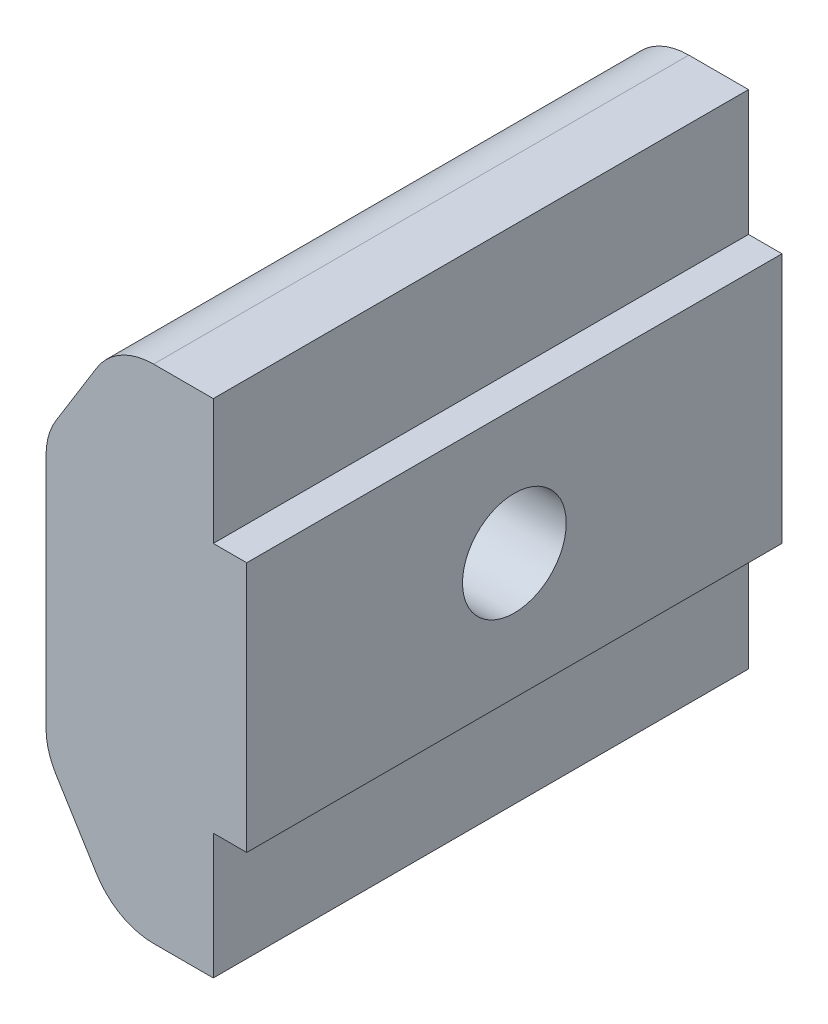
ISO-10303-21;
HEADER;
FILE_DESCRIPTION(('STEP AP214'),'2;1');
FILE_NAME('part.step','',(''),(''),'','','');
FILE_SCHEMA(('AUTOMOTIVE_DESIGN { 1 0 10303 214 1 1 1 1 }'));
ENDSEC;
DATA;
#1=APPLICATION_CONTEXT('core data for automotive mechanical design processes');
#2=APPLICATION_PROTOCOL_DEFINITION('international standard','automotive_design',2000,#1);
#3=PRODUCT_CONTEXT('',#1,'mechanical');
#4=PRODUCT('Part','Part','',(#3));
#5=PRODUCT_RELATED_PRODUCT_CATEGORY('part','',(#4));
#6=PRODUCT_DEFINITION_FORMATION('','',#4);
#7=PRODUCT_DEFINITION_CONTEXT('part definition',#1,'design');
#8=PRODUCT_DEFINITION('design','',#6,#7);
#9=PRODUCT_DEFINITION_SHAPE('','',#8);
#10=(LENGTH_UNIT() NAMED_UNIT(*) SI_UNIT(.MILLI.,.METRE.));
#11=(NAMED_UNIT(*) PLANE_ANGLE_UNIT() SI_UNIT($,.RADIAN.));
#12=(NAMED_UNIT(*) SI_UNIT($,.STERADIAN.) SOLID_ANGLE_UNIT());
#13=UNCERTAINTY_MEASURE_WITH_UNIT(LENGTH_MEASURE(1.E-05),#10,'distance_accuracy_value','');
#14=(GEOMETRIC_REPRESENTATION_CONTEXT(3) GLOBAL_UNCERTAINTY_ASSIGNED_CONTEXT((#13)) GLOBAL_UNIT_ASSIGNED_CONTEXT((#10,
#11,#12)) REPRESENTATION_CONTEXT('',''));
#15=CARTESIAN_POINT('',(0.,0.,0.));
#16=DIRECTION('',(0.,0.,1.));
#17=DIRECTION('',(1.,0.,0.));
#18=AXIS2_PLACEMENT_3D('',#15,#16,#17);
#19=CARTESIAN_POINT('',(5.,-3.4,16.));
#20=DIRECTION('',(-1.,0.,0.));
#21=DIRECTION('',(0.,-1.,0.));
#22=AXIS2_PLACEMENT_3D('',#19,#20,#21);
#23=PLANE('',#22);
#24=DIRECTION('',(0.,0.,-1.));
#25=VECTOR('',#24,1.);
#26=CARTESIAN_POINT('',(5.,0.349999999999997,16.));
#27=LINE('',#26,#25);
#28=CARTESIAN_POINT('',(5.,0.349999999999995,16.));
#29=VERTEX_POINT('',#28);
#30=CARTESIAN_POINT('',(5.,0.349999999999995,0.));
#31=VERTEX_POINT('',#30);
#32=EDGE_CURVE('E54',#29,#31,#27,.T.);
#33=ORIENTED_EDGE('',*,*,#32,.F.);
#34=DIRECTION('',(0.,1.,0.));
#35=VECTOR('',#34,1.);
#36=CARTESIAN_POINT('',(5.,-3.4,16.));
#37=LINE('',#36,#35);
#38=CARTESIAN_POINT('',(5.,-3.4,16.));
#39=VERTEX_POINT('',#38);
#40=EDGE_CURVE('E255',#39,#29,#37,.T.);
#41=ORIENTED_EDGE('',*,*,#40,.F.);
#42=DIRECTION('',(0.,0.,-1.));
#43=VECTOR('',#42,1.);
#44=CARTESIAN_POINT('',(5.,-3.4,16.));
#45=LINE('',#44,#43);
#46=CARTESIAN_POINT('',(5.,-3.4,0.));
#47=VERTEX_POINT('',#46);
#48=EDGE_CURVE('E272',#39,#47,#45,.T.);
#49=ORIENTED_EDGE('',*,*,#48,.T.);
#50=DIRECTION('',(0.,1.,0.));
#51=VECTOR('',#50,1.);
#52=CARTESIAN_POINT('',(5.,-3.4,0.));
#53=LINE('',#52,#51);
#54=EDGE_CURVE('E273',#47,#31,#53,.T.);
#55=ORIENTED_EDGE('',*,*,#54,.T.);
#56=EDGE_LOOP('',(#33,#41,#49,#55));
#57=FACE_BOUND('',#56,.T.);
#58=ADVANCED_FACE('F37',(#57),#23,.F.);
#59=DIRECTION('',(0.,0.,1.));
#60=VECTOR('',#59,1.);
#61=CARTESIAN_POINT('',(5.,7.85,16.));
#62=LINE('',#61,#60);
#63=CARTESIAN_POINT('',(5.,7.84999999999999,0.));
#64=VERTEX_POINT('',#63);
#65=CARTESIAN_POINT('',(5.,7.85,16.));
#66=VERTEX_POINT('',#65);
#67=EDGE_CURVE('E62',#64,#66,#62,.T.);
#68=ORIENTED_EDGE('',*,*,#67,.F.);
#69=CARTESIAN_POINT('',(5.,11.6,0.));
#70=VERTEX_POINT('',#69);
#71=EDGE_CURVE('E276',#64,#70,#53,.T.);
#72=ORIENTED_EDGE('',*,*,#71,.T.);
#73=DIRECTION('',(0.,0.,-1.));
#74=VECTOR('',#73,1.);
#75=CARTESIAN_POINT('',(5.,11.6,16.));
#76=LINE('',#75,#74);
#77=CARTESIAN_POINT('',(5.,11.6,16.));
#78=VERTEX_POINT('',#77);
#79=EDGE_CURVE('E292',#78,#70,#76,.T.);
#80=ORIENTED_EDGE('',*,*,#79,.F.);
#81=EDGE_CURVE('E258',#66,#78,#37,.T.);
#82=ORIENTED_EDGE('',*,*,#81,.F.);
#83=EDGE_LOOP('',(#68,#72,#80,#82));
#84=FACE_BOUND('',#83,.T.);
#85=ADVANCED_FACE('F390',(#84),#23,.F.);
#86=CARTESIAN_POINT('',(9.38406204335659,4.1,8.));
#87=DIRECTION('',(-1.,0.,0.));
#88=DIRECTION('',(0.,-1.,0.));
#89=AXIS2_PLACEMENT_3D('',#86,#87,#88);
#90=CYLINDRICAL_SURFACE('',#89,1.55);
#91=CARTESIAN_POINT('',(2.5,4.1,8.));
#92=DIRECTION('',(-1.,0.,0.));
#93=DIRECTION('',(0.,-1.,0.));
#94=AXIS2_PLACEMENT_3D('',#91,#92,#93);
#95=CIRCLE('',#94,1.55);
#96=CARTESIAN_POINT('',(2.5,2.55,8.));
#97=VERTEX_POINT('',#96);
#98=EDGE_CURVE('E244',#97,#97,#95,.F.);
#99=ORIENTED_EDGE('',*,*,#98,.F.);
#100=EDGE_LOOP('',(#99));
#101=FACE_BOUND('',#100,.T.);
#102=CARTESIAN_POINT('',(6.,4.1,8.));
#103=DIRECTION('',(1.,0.,0.));
#104=DIRECTION('',(0.,1.,0.));
#105=AXIS2_PLACEMENT_3D('',#102,#103,#104);
#106=CIRCLE('',#105,1.55);
#107=CARTESIAN_POINT('',(6.,5.65,8.));
#108=VERTEX_POINT('',#107);
#109=EDGE_CURVE('E372',#108,#108,#106,.T.);
#110=ORIENTED_EDGE('',*,*,#109,.T.);
#111=EDGE_LOOP('',(#110));
#112=FACE_BOUND('',#111,.T.);
#113=ADVANCED_FACE('F378',(#101,#112),#90,.F.);
#114=CARTESIAN_POINT('',(2.1,11.6,16.));
#115=DIRECTION('',(0.,-1.,0.));
#116=DIRECTION('',(0.,0.,-1.));
#117=AXIS2_PLACEMENT_3D('',#114,#115,#116);
#118=PLANE('',#117);
#119=DIRECTION('',(-1.,0.,0.));
#120=VECTOR('',#119,1.);
#121=CARTESIAN_POINT('',(2.1,11.6,0.));
#122=LINE('',#121,#120);
#123=CARTESIAN_POINT('',(3.21544014149272,11.6,0.));
#124=VERTEX_POINT('',#123);
#125=EDGE_CURVE('E275',#70,#124,#122,.T.);
#126=ORIENTED_EDGE('',*,*,#125,.T.);
#127=DIRECTION('',(0.,0.,-1.));
#128=VECTOR('',#127,1.);
#129=CARTESIAN_POINT('',(3.21544014149272,11.6,16.));
#130=LINE('',#129,#128);
#131=CARTESIAN_POINT('',(3.21544014149272,11.6,16.));
#132=VERTEX_POINT('',#131);
#133=EDGE_CURVE('E11',#124,#132,#130,.F.);
#134=ORIENTED_EDGE('',*,*,#133,.T.);
#135=DIRECTION('',(-1.,0.,0.));
#136=VECTOR('',#135,1.);
#137=CARTESIAN_POINT('',(2.1,11.6,16.));
#138=LINE('',#137,#136);
#139=EDGE_CURVE('E257',#78,#132,#138,.T.);
#140=ORIENTED_EDGE('',*,*,#139,.F.);
#141=ORIENTED_EDGE('',*,*,#79,.T.);
#142=EDGE_LOOP('',(#126,#134,#140,#141));
#143=FACE_BOUND('',#142,.T.);
#144=ADVANCED_FACE('F397',(#143),#118,.F.);
#145=CARTESIAN_POINT('',(0.,8.2,16.));
#146=DIRECTION('',(0.850797997359292,-0.525492880721916,0.));
#147=DIRECTION('',(0.525492880721916,0.850797997359292,0.));
#148=AXIS2_PLACEMENT_3D('',#145,#146,#147);
#149=PLANE('',#148);
#150=DIRECTION('',(-0.525492880721916,-0.850797997359292,0.));
#151=VECTOR('',#150,1.);
#152=CARTESIAN_POINT('',(0.,8.2,0.));
#153=LINE('',#152,#151);
#154=CARTESIAN_POINT('',(1.51384414677413,10.6509857614438,0.));
#155=VERTEX_POINT('',#154);
#156=CARTESIAN_POINT('',(0.298404005281414,8.68313029426515,0.));
#157=VERTEX_POINT('',#156);
#158=EDGE_CURVE('E279',#155,#157,#153,.T.);
#159=ORIENTED_EDGE('',*,*,#158,.T.);
#160=DIRECTION('',(0.,0.,-1.));
#161=VECTOR('',#160,1.);
#162=CARTESIAN_POINT('',(0.298404005281414,8.68313029426515,16.));
#163=LINE('',#162,#161);
#164=CARTESIAN_POINT('',(0.298404005281414,8.68313029426515,16.));
#165=VERTEX_POINT('',#164);
#166=EDGE_CURVE('E45',#157,#165,#163,.F.);
#167=ORIENTED_EDGE('',*,*,#166,.T.);
#168=DIRECTION('',(-0.525492880721916,-0.850797997359292,0.));
#169=VECTOR('',#168,1.);
#170=CARTESIAN_POINT('',(0.,8.2,16.));
#171=LINE('',#170,#169);
#172=CARTESIAN_POINT('',(1.51384414677413,10.6509857614438,16.));
#173=VERTEX_POINT('',#172);
#174=EDGE_CURVE('E261',#173,#165,#171,.T.);
#175=ORIENTED_EDGE('',*,*,#174,.F.);
#176=DIRECTION('',(0.,0.,-1.));
#177=VECTOR('',#176,1.);
#178=CARTESIAN_POINT('',(1.51384414677413,10.6509857614438,16.));
#179=LINE('',#178,#177);
#180=EDGE_CURVE('E326',#173,#155,#179,.T.);
#181=ORIENTED_EDGE('',*,*,#180,.T.);
#182=EDGE_LOOP('',(#159,#167,#175,#181));
#183=FACE_BOUND('',#182,.T.);
#184=ADVANCED_FACE('F331',(#183),#149,.F.);
#185=CARTESIAN_POINT('',(0.,0.,16.));
#186=DIRECTION('',(1.,0.,0.));
#187=DIRECTION('',(0.,1.,0.));
#188=AXIS2_PLACEMENT_3D('',#185,#186,#187);
#189=PLANE('',#188);
#190=DIRECTION('',(0.,0.866025403784439,-0.5));
#191=VECTOR('',#190,1.);
#192=CARTESIAN_POINT('',(0.,4.1,11.3486315612998));
#193=LINE('',#192,#191);
#194=CARTESIAN_POINT('',(0.,4.1,11.3486315612998));
#195=VERTEX_POINT('',#194);
#196=CARTESIAN_POINT('',(0.,6.99999999999999,9.67431578064991));
#197=VERTEX_POINT('',#196);
#198=EDGE_CURVE('E203',#195,#197,#193,.T.);
#199=ORIENTED_EDGE('',*,*,#198,.F.);
#200=DIRECTION('',(0.,0.866025403784439,0.5));
#201=VECTOR('',#200,1.);
#202=CARTESIAN_POINT('',(0.,1.2,9.67431578064991));
#203=LINE('',#202,#201);
#204=CARTESIAN_POINT('',(0.,1.2,9.67431578064991));
#205=VERTEX_POINT('',#204);
#206=EDGE_CURVE('E201',#205,#195,#203,.T.);
#207=ORIENTED_EDGE('',*,*,#206,.F.);
#208=DIRECTION('',(0.,0.,1.));
#209=VECTOR('',#208,1.);
#210=CARTESIAN_POINT('',(0.,1.2,6.32568421935009));
#211=LINE('',#210,#209);
#212=CARTESIAN_POINT('',(0.,1.2,6.32568421935009));
#213=VERTEX_POINT('',#212);
#214=EDGE_CURVE('E213',#213,#205,#211,.T.);
#215=ORIENTED_EDGE('',*,*,#214,.F.);
#216=DIRECTION('',(0.,-0.866025403784439,0.5));
#217=VECTOR('',#216,1.);
#218=CARTESIAN_POINT('',(0.,4.1,4.65136843870017));
#219=LINE('',#218,#217);
#220=CARTESIAN_POINT('',(0.,4.1,4.65136843870017));
#221=VERTEX_POINT('',#220);
#222=EDGE_CURVE('E237',#221,#213,#219,.T.);
#223=ORIENTED_EDGE('',*,*,#222,.F.);
#224=DIRECTION('',(0.,-0.866025403784439,-0.5));
#225=VECTOR('',#224,1.);
#226=CARTESIAN_POINT('',(0.,7.,6.32568421935009));
#227=LINE('',#226,#225);
#228=CARTESIAN_POINT('',(0.,7.,6.32568421935009));
#229=VERTEX_POINT('',#228);
#230=EDGE_CURVE('E234',#229,#221,#227,.T.);
#231=ORIENTED_EDGE('',*,*,#230,.F.);
#232=DIRECTION('',(0.,0.,-1.));
#233=VECTOR('',#232,1.);
#234=CARTESIAN_POINT('',(0.,6.99999999999999,9.67431578064991));
#235=LINE('',#234,#233);
#236=EDGE_CURVE('E231',#197,#229,#235,.T.);
#237=ORIENTED_EDGE('',*,*,#236,.F.);
#238=EDGE_LOOP('',(#199,#207,#215,#223,#231,#237));
#239=FACE_BOUND('',#238,.T.);
#240=DIRECTION('',(0.,-1.,0.));
#241=VECTOR('',#240,1.);
#242=CARTESIAN_POINT('',(0.,0.,0.));
#243=LINE('',#242,#241);
#244=CARTESIAN_POINT('',(0.,7.63214453282131,0.));
#245=VERTEX_POINT('',#244);
#246=CARTESIAN_POINT('',(0.,0.567855467178683,0.));
#247=VERTEX_POINT('',#246);
#248=EDGE_CURVE('E282',#245,#247,#243,.T.);
#249=ORIENTED_EDGE('',*,*,#248,.T.);
#250=DIRECTION('',(0.,0.,-1.));
#251=VECTOR('',#250,1.);
#252=CARTESIAN_POINT('',(0.,0.567855467178683,16.));
#253=LINE('',#252,#251);
#254=CARTESIAN_POINT('',(0.,0.567855467178683,16.));
#255=VERTEX_POINT('',#254);
#256=EDGE_CURVE('E324',#247,#255,#253,.F.);
#257=ORIENTED_EDGE('',*,*,#256,.T.);
#258=DIRECTION('',(0.,-1.,0.));
#259=VECTOR('',#258,1.);
#260=CARTESIAN_POINT('',(0.,0.,16.));
#261=LINE('',#260,#259);
#262=CARTESIAN_POINT('',(0.,7.63214453282131,16.));
#263=VERTEX_POINT('',#262);
#264=EDGE_CURVE('E264',#263,#255,#261,.T.);
#265=ORIENTED_EDGE('',*,*,#264,.F.);
#266=DIRECTION('',(0.,0.,-1.));
#267=VECTOR('',#266,1.);
#268=CARTESIAN_POINT('',(0.,7.63214453282131,16.));
#269=LINE('',#268,#267);
#270=EDGE_CURVE('E321',#263,#245,#269,.T.);
#271=ORIENTED_EDGE('',*,*,#270,.T.);
#272=EDGE_LOOP('',(#249,#257,#265,#271));
#273=FACE_BOUND('',#272,.T.);
#274=ADVANCED_FACE('F344',(#239,#273),#189,.F.);
#275=CARTESIAN_POINT('',(0.,0.,16.));
#276=DIRECTION('',(0.850797997359292,0.525492880721916,0.));
#277=DIRECTION('',(-0.525492880721916,0.850797997359292,0.));
#278=AXIS2_PLACEMENT_3D('',#275,#276,#277);
#279=PLANE('',#278);
#280=DIRECTION('',(0.525492880721916,-0.850797997359292,0.));
#281=VECTOR('',#280,1.);
#282=CARTESIAN_POINT('',(0.,0.,0.));
#283=LINE('',#282,#281);
#284=CARTESIAN_POINT('',(0.298404005281415,-0.483130294265149,0.));
#285=VERTEX_POINT('',#284);
#286=CARTESIAN_POINT('',(1.51384414677413,-2.45098576144383,0.));
#287=VERTEX_POINT('',#286);
#288=EDGE_CURVE('E285',#285,#287,#283,.T.);
#289=ORIENTED_EDGE('',*,*,#288,.T.);
#290=DIRECTION('',(0.,0.,-1.));
#291=VECTOR('',#290,1.);
#292=CARTESIAN_POINT('',(1.51384414677413,-2.45098576144383,16.));
#293=LINE('',#292,#291);
#294=CARTESIAN_POINT('',(1.51384414677413,-2.45098576144383,16.));
#295=VERTEX_POINT('',#294);
#296=EDGE_CURVE('E311',#287,#295,#293,.F.);
#297=ORIENTED_EDGE('',*,*,#296,.T.);
#298=DIRECTION('',(0.525492880721916,-0.850797997359292,0.));
#299=VECTOR('',#298,1.);
#300=CARTESIAN_POINT('',(0.,0.,16.));
#301=LINE('',#300,#299);
#302=CARTESIAN_POINT('',(0.298404005281415,-0.483130294265149,16.));
#303=VERTEX_POINT('',#302);
#304=EDGE_CURVE('E267',#303,#295,#301,.T.);
#305=ORIENTED_EDGE('',*,*,#304,.F.);
#306=DIRECTION('',(0.,0.,-1.));
#307=VECTOR('',#306,1.);
#308=CARTESIAN_POINT('',(0.298404005281415,-0.483130294265149,16.));
#309=LINE('',#308,#307);
#310=EDGE_CURVE('E308',#303,#285,#309,.T.);
#311=ORIENTED_EDGE('',*,*,#310,.T.);
#312=EDGE_LOOP('',(#289,#297,#305,#311));
#313=FACE_BOUND('',#312,.T.);
#314=ADVANCED_FACE('F353',(#313),#279,.F.);
#315=CARTESIAN_POINT('',(2.1,-3.4,16.));
#316=DIRECTION('',(0.,1.,0.));
#317=DIRECTION('',(-1.,0.,0.));
#318=AXIS2_PLACEMENT_3D('',#315,#316,#317);
#319=PLANE('',#318);
#320=DIRECTION('',(1.,0.,0.));
#321=VECTOR('',#320,1.);
#322=CARTESIAN_POINT('',(2.1,-3.4,16.));
#323=LINE('',#322,#321);
#324=CARTESIAN_POINT('',(3.21544014149272,-3.4,16.));
#325=VERTEX_POINT('',#324);
#326=EDGE_CURVE('E270',#325,#39,#323,.T.);
#327=ORIENTED_EDGE('',*,*,#326,.F.);
#328=DIRECTION('',(0.,0.,-1.));
#329=VECTOR('',#328,1.);
#330=CARTESIAN_POINT('',(3.21544014149272,-3.4,16.));
#331=LINE('',#330,#329);
#332=CARTESIAN_POINT('',(3.21544014149272,-3.4,0.));
#333=VERTEX_POINT('',#332);
#334=EDGE_CURVE('E295',#325,#333,#331,.T.);
#335=ORIENTED_EDGE('',*,*,#334,.T.);
#336=DIRECTION('',(1.,0.,0.));
#337=VECTOR('',#336,1.);
#338=CARTESIAN_POINT('',(2.1,-3.4,0.));
#339=LINE('',#338,#337);
#340=EDGE_CURVE('E288',#333,#47,#339,.T.);
#341=ORIENTED_EDGE('',*,*,#340,.T.);
#342=ORIENTED_EDGE('',*,*,#48,.F.);
#343=EDGE_LOOP('',(#327,#335,#341,#342));
#344=FACE_BOUND('',#343,.T.);
#345=ADVANCED_FACE('F361',(#344),#319,.F.);
#346=CARTESIAN_POINT('',(0.,0.,16.));
#347=DIRECTION('',(0.,0.,-1.));
#348=DIRECTION('',(-1.,0.,0.));
#349=AXIS2_PLACEMENT_3D('',#346,#347,#348);
#350=PLANE('',#349);
#351=ORIENTED_EDGE('',*,*,#304,.T.);
#352=CARTESIAN_POINT('',(3.21544014149272,-1.4,16.));
#353=DIRECTION('',(0.,0.,-1.));
#354=DIRECTION('',(-1.,0.,0.));
#355=AXIS2_PLACEMENT_3D('',#352,#353,#354);
#356=CIRCLE('',#355,2.);
#357=EDGE_CURVE('E319',#295,#325,#356,.F.);
#358=ORIENTED_EDGE('',*,*,#357,.T.);
#359=ORIENTED_EDGE('',*,*,#326,.T.);
#360=ORIENTED_EDGE('',*,*,#40,.T.);
#361=DIRECTION('',(-1.,0.,0.));
#362=VECTOR('',#361,1.);
#363=CARTESIAN_POINT('',(6.,0.349999999999997,16.));
#364=LINE('',#363,#362);
#365=CARTESIAN_POINT('',(6.,0.349999999999997,16.));
#366=VERTEX_POINT('',#365);
#367=EDGE_CURVE('E363',#366,#29,#364,.T.);
#368=ORIENTED_EDGE('',*,*,#367,.F.);
#369=DIRECTION('',(0.,-1.,0.));
#370=VECTOR('',#369,1.);
#371=CARTESIAN_POINT('',(6.,7.85,16.));
#372=LINE('',#371,#370);
#373=CARTESIAN_POINT('',(6.,7.85,16.));
#374=VERTEX_POINT('',#373);
#375=EDGE_CURVE('E194',#374,#366,#372,.T.);
#376=ORIENTED_EDGE('',*,*,#375,.F.);
#377=DIRECTION('',(-1.,0.,0.));
#378=VECTOR('',#377,1.);
#379=CARTESIAN_POINT('',(6.,7.85,16.));
#380=LINE('',#379,#378);
#381=EDGE_CURVE('E205',#374,#66,#380,.T.);
#382=ORIENTED_EDGE('',*,*,#381,.T.);
#383=ORIENTED_EDGE('',*,*,#81,.T.);
#384=ORIENTED_EDGE('',*,*,#139,.T.);
#385=CARTESIAN_POINT('',(3.21544014149272,9.6,16.));
#386=DIRECTION('',(0.,0.,-1.));
#387=DIRECTION('',(-1.,0.,0.));
#388=AXIS2_PLACEMENT_3D('',#385,#386,#387);
#389=CIRCLE('',#388,2.);
#390=EDGE_CURVE('E313',#132,#173,#389,.F.);
#391=ORIENTED_EDGE('',*,*,#390,.T.);
#392=ORIENTED_EDGE('',*,*,#174,.T.);
#393=CARTESIAN_POINT('',(2.,7.63214453282131,16.));
#394=DIRECTION('',(0.,0.,-1.));
#395=DIRECTION('',(-1.,0.,0.));
#396=AXIS2_PLACEMENT_3D('',#393,#394,#395);
#397=CIRCLE('',#396,2.);
#398=EDGE_CURVE('E315',#165,#263,#397,.F.);
#399=ORIENTED_EDGE('',*,*,#398,.T.);
#400=ORIENTED_EDGE('',*,*,#264,.T.);
#401=CARTESIAN_POINT('',(2.,0.567855467178683,16.));
#402=DIRECTION('',(0.,0.,-1.));
#403=DIRECTION('',(-1.,0.,0.));
#404=AXIS2_PLACEMENT_3D('',#401,#402,#403);
#405=CIRCLE('',#404,2.);
#406=EDGE_CURVE('E317',#255,#303,#405,.F.);
#407=ORIENTED_EDGE('',*,*,#406,.T.);
#408=EDGE_LOOP('',(#351,#358,#359,#360,#368,#376,#382,#383,#384,#391,#392,#399,#400,#407));
#409=FACE_BOUND('',#408,.T.);
#410=ADVANCED_FACE('F337',(#409),#350,.F.);
#411=CARTESIAN_POINT('',(0.,0.,0.));
#412=DIRECTION('',(0.,0.,-1.));
#413=DIRECTION('',(-1.,0.,0.));
#414=AXIS2_PLACEMENT_3D('',#411,#412,#413);
#415=PLANE('',#414);
#416=ORIENTED_EDGE('',*,*,#340,.F.);
#417=CARTESIAN_POINT('',(3.21544014149272,-1.4,0.));
#418=DIRECTION('',(0.,0.,-1.));
#419=DIRECTION('',(-1.,0.,0.));
#420=AXIS2_PLACEMENT_3D('',#417,#418,#419);
#421=CIRCLE('',#420,2.);
#422=EDGE_CURVE('E306',#333,#287,#421,.T.);
#423=ORIENTED_EDGE('',*,*,#422,.T.);
#424=ORIENTED_EDGE('',*,*,#288,.F.);
#425=CARTESIAN_POINT('',(2.,0.567855467178683,0.));
#426=DIRECTION('',(0.,0.,-1.));
#427=DIRECTION('',(-1.,0.,0.));
#428=AXIS2_PLACEMENT_3D('',#425,#426,#427);
#429=CIRCLE('',#428,2.);
#430=EDGE_CURVE('E304',#285,#247,#429,.T.);
#431=ORIENTED_EDGE('',*,*,#430,.T.);
#432=ORIENTED_EDGE('',*,*,#248,.F.);
#433=CARTESIAN_POINT('',(2.,7.63214453282131,0.));
#434=DIRECTION('',(0.,0.,-1.));
#435=DIRECTION('',(-1.,0.,0.));
#436=AXIS2_PLACEMENT_3D('',#433,#434,#435);
#437=CIRCLE('',#436,2.);
#438=EDGE_CURVE('E302',#245,#157,#437,.T.);
#439=ORIENTED_EDGE('',*,*,#438,.T.);
#440=ORIENTED_EDGE('',*,*,#158,.F.);
#441=CARTESIAN_POINT('',(3.21544014149272,9.6,0.));
#442=DIRECTION('',(0.,0.,-1.));
#443=DIRECTION('',(-1.,0.,0.));
#444=AXIS2_PLACEMENT_3D('',#441,#442,#443);
#445=CIRCLE('',#444,2.);
#446=EDGE_CURVE('E300',#155,#124,#445,.T.);
#447=ORIENTED_EDGE('',*,*,#446,.T.);
#448=ORIENTED_EDGE('',*,*,#125,.F.);
#449=ORIENTED_EDGE('',*,*,#71,.F.);
#450=DIRECTION('',(-1.,0.,0.));
#451=VECTOR('',#450,1.);
#452=CARTESIAN_POINT('',(6.,7.84999999999999,0.));
#453=LINE('',#452,#451);
#454=CARTESIAN_POINT('',(6.,7.84999999999999,0.));
#455=VERTEX_POINT('',#454);
#456=EDGE_CURVE('E184',#455,#64,#453,.T.);
#457=ORIENTED_EDGE('',*,*,#456,.F.);
#458=DIRECTION('',(0.,1.,0.));
#459=VECTOR('',#458,1.);
#460=CARTESIAN_POINT('',(6.,7.84999999999999,0.));
#461=LINE('',#460,#459);
#462=CARTESIAN_POINT('',(6.,0.349999999999996,0.));
#463=VERTEX_POINT('',#462);
#464=EDGE_CURVE('E176',#463,#455,#461,.T.);
#465=ORIENTED_EDGE('',*,*,#464,.F.);
#466=DIRECTION('',(-1.,0.,0.));
#467=VECTOR('',#466,1.);
#468=CARTESIAN_POINT('',(6.,0.349999999999996,0.));
#469=LINE('',#468,#467);
#470=EDGE_CURVE('E182',#463,#31,#469,.T.);
#471=ORIENTED_EDGE('',*,*,#470,.T.);
#472=ORIENTED_EDGE('',*,*,#54,.F.);
#473=EDGE_LOOP('',(#416,#423,#424,#431,#432,#439,#440,#447,#448,#449,#457,#465,#471,#472));
#474=FACE_BOUND('',#473,.T.);
#475=ADVANCED_FACE('F179',(#474),#415,.T.);
#476=CARTESIAN_POINT('',(2.5,0.,0.));
#477=DIRECTION('',(-1.,0.,0.));
#478=DIRECTION('',(0.,-1.,0.));
#479=AXIS2_PLACEMENT_3D('',#476,#477,#478);
#480=PLANE('',#479);
#481=DIRECTION('',(0.,0.866025403784439,0.5));
#482=VECTOR('',#481,1.);
#483=CARTESIAN_POINT('',(2.5,1.2,9.67431578064991));
#484=LINE('',#483,#482);
#485=CARTESIAN_POINT('',(2.5,1.2,9.67431578064991));
#486=VERTEX_POINT('',#485);
#487=CARTESIAN_POINT('',(2.5,4.1,11.3486315612998));
#488=VERTEX_POINT('',#487);
#489=EDGE_CURVE('E209',#486,#488,#484,.T.);
#490=ORIENTED_EDGE('',*,*,#489,.T.);
#491=DIRECTION('',(0.,0.866025403784439,-0.5));
#492=VECTOR('',#491,1.);
#493=CARTESIAN_POINT('',(2.5,4.1,11.3486315612998));
#494=LINE('',#493,#492);
#495=CARTESIAN_POINT('',(2.5,6.99999999999999,9.67431578064991));
#496=VERTEX_POINT('',#495);
#497=EDGE_CURVE('E212',#488,#496,#494,.T.);
#498=ORIENTED_EDGE('',*,*,#497,.T.);
#499=DIRECTION('',(0.,0.,-1.));
#500=VECTOR('',#499,1.);
#501=CARTESIAN_POINT('',(2.5,6.99999999999999,9.67431578064991));
#502=LINE('',#501,#500);
#503=CARTESIAN_POINT('',(2.5,7.,6.32568421935009));
#504=VERTEX_POINT('',#503);
#505=EDGE_CURVE('E216',#496,#504,#502,.T.);
#506=ORIENTED_EDGE('',*,*,#505,.T.);
#507=DIRECTION('',(0.,-0.866025403784439,-0.5));
#508=VECTOR('',#507,1.);
#509=CARTESIAN_POINT('',(2.5,7.,6.32568421935009));
#510=LINE('',#509,#508);
#511=CARTESIAN_POINT('',(2.5,4.1,4.65136843870017));
#512=VERTEX_POINT('',#511);
#513=EDGE_CURVE('E219',#504,#512,#510,.T.);
#514=ORIENTED_EDGE('',*,*,#513,.T.);
#515=DIRECTION('',(0.,-0.866025403784439,0.5));
#516=VECTOR('',#515,1.);
#517=CARTESIAN_POINT('',(2.5,4.1,4.65136843870017));
#518=LINE('',#517,#516);
#519=CARTESIAN_POINT('',(2.5,1.2,6.32568421935009));
#520=VERTEX_POINT('',#519);
#521=EDGE_CURVE('E222',#512,#520,#518,.T.);
#522=ORIENTED_EDGE('',*,*,#521,.T.);
#523=DIRECTION('',(0.,0.,1.));
#524=VECTOR('',#523,1.);
#525=CARTESIAN_POINT('',(2.5,1.2,6.32568421935009));
#526=LINE('',#525,#524);
#527=EDGE_CURVE('E225',#520,#486,#526,.T.);
#528=ORIENTED_EDGE('',*,*,#527,.T.);
#529=EDGE_LOOP('',(#490,#498,#506,#514,#522,#528));
#530=FACE_BOUND('',#529,.T.);
#531=ORIENTED_EDGE('',*,*,#98,.T.);
#532=EDGE_LOOP('',(#531));
#533=FACE_BOUND('',#532,.T.);
#534=ADVANCED_FACE('F451',(#530,#533),#480,.T.);
#535=CARTESIAN_POINT('',(2.5,1.2,9.67431578064991));
#536=DIRECTION('',(0.,-0.5,0.866025403784439));
#537=DIRECTION('',(0.,-0.866025403784439,-0.5));
#538=AXIS2_PLACEMENT_3D('',#535,#536,#537);
#539=PLANE('',#538);
#540=ORIENTED_EDGE('',*,*,#206,.T.);
#541=DIRECTION('',(-1.,0.,0.));
#542=VECTOR('',#541,1.);
#543=CARTESIAN_POINT('',(2.5,4.1,11.3486315612998));
#544=LINE('',#543,#542);
#545=EDGE_CURVE('E227',#488,#195,#544,.T.);
#546=ORIENTED_EDGE('',*,*,#545,.F.);
#547=ORIENTED_EDGE('',*,*,#489,.F.);
#548=DIRECTION('',(-1.,0.,0.));
#549=VECTOR('',#548,1.);
#550=CARTESIAN_POINT('',(2.5,1.2,9.67431578064991));
#551=LINE('',#550,#549);
#552=EDGE_CURVE('E242',#486,#205,#551,.T.);
#553=ORIENTED_EDGE('',*,*,#552,.T.);
#554=EDGE_LOOP('',(#540,#546,#547,#553));
#555=FACE_BOUND('',#554,.T.);
#556=ADVANCED_FACE('F478',(#555),#539,.F.);
#557=CARTESIAN_POINT('',(2.5,1.2,6.32568421935009));
#558=DIRECTION('',(0.,-1.,0.));
#559=DIRECTION('',(0.,0.,-1.));
#560=AXIS2_PLACEMENT_3D('',#557,#558,#559);
#561=PLANE('',#560);
#562=ORIENTED_EDGE('',*,*,#214,.T.);
#563=ORIENTED_EDGE('',*,*,#552,.F.);
#564=ORIENTED_EDGE('',*,*,#527,.F.);
#565=DIRECTION('',(-1.,0.,0.));
#566=VECTOR('',#565,1.);
#567=CARTESIAN_POINT('',(2.5,1.2,6.32568421935009));
#568=LINE('',#567,#566);
#569=EDGE_CURVE('E245',#520,#213,#568,.T.);
#570=ORIENTED_EDGE('',*,*,#569,.T.);
#571=EDGE_LOOP('',(#562,#563,#564,#570));
#572=FACE_BOUND('',#571,.T.);
#573=ADVANCED_FACE('F480',(#572),#561,.F.);
#574=CARTESIAN_POINT('',(2.5,4.1,4.65136843870017));
#575=DIRECTION('',(0.,-0.5,-0.866025403784439));
#576=DIRECTION('',(0.,0.866025403784439,-0.5));
#577=AXIS2_PLACEMENT_3D('',#574,#575,#576);
#578=PLANE('',#577);
#579=ORIENTED_EDGE('',*,*,#222,.T.);
#580=ORIENTED_EDGE('',*,*,#569,.F.);
#581=ORIENTED_EDGE('',*,*,#521,.F.);
#582=DIRECTION('',(-1.,0.,0.));
#583=VECTOR('',#582,1.);
#584=CARTESIAN_POINT('',(2.5,4.1,4.65136843870017));
#585=LINE('',#584,#583);
#586=EDGE_CURVE('E247',#512,#221,#585,.T.);
#587=ORIENTED_EDGE('',*,*,#586,.T.);
#588=EDGE_LOOP('',(#579,#580,#581,#587));
#589=FACE_BOUND('',#588,.T.);
#590=ADVANCED_FACE('F483',(#589),#578,.F.);
#591=CARTESIAN_POINT('',(2.5,7.,6.32568421935009));
#592=DIRECTION('',(0.,0.5,-0.866025403784439));
#593=DIRECTION('',(0.,0.866025403784439,0.5));
#594=AXIS2_PLACEMENT_3D('',#591,#592,#593);
#595=PLANE('',#594);
#596=ORIENTED_EDGE('',*,*,#230,.T.);
#597=ORIENTED_EDGE('',*,*,#586,.F.);
#598=ORIENTED_EDGE('',*,*,#513,.F.);
#599=DIRECTION('',(-1.,0.,0.));
#600=VECTOR('',#599,1.);
#601=CARTESIAN_POINT('',(2.5,7.,6.32568421935009));
#602=LINE('',#601,#600);
#603=EDGE_CURVE('E249',#504,#229,#602,.T.);
#604=ORIENTED_EDGE('',*,*,#603,.T.);
#605=EDGE_LOOP('',(#596,#597,#598,#604));
#606=FACE_BOUND('',#605,.T.);
#607=ADVANCED_FACE('F487',(#606),#595,.F.);
#608=CARTESIAN_POINT('',(2.5,6.99999999999999,9.67431578064991));
#609=DIRECTION('',(0.,1.,0.));
#610=DIRECTION('',(0.,0.,1.));
#611=AXIS2_PLACEMENT_3D('',#608,#609,#610);
#612=PLANE('',#611);
#613=ORIENTED_EDGE('',*,*,#236,.T.);
#614=ORIENTED_EDGE('',*,*,#603,.F.);
#615=ORIENTED_EDGE('',*,*,#505,.F.);
#616=DIRECTION('',(-1.,0.,0.));
#617=VECTOR('',#616,1.);
#618=CARTESIAN_POINT('',(2.5,6.99999999999999,9.67431578064991));
#619=LINE('',#618,#617);
#620=EDGE_CURVE('E251',#496,#197,#619,.T.);
#621=ORIENTED_EDGE('',*,*,#620,.T.);
#622=EDGE_LOOP('',(#613,#614,#615,#621));
#623=FACE_BOUND('',#622,.T.);
#624=ADVANCED_FACE('F491',(#623),#612,.F.);
#625=CARTESIAN_POINT('',(2.5,4.1,11.3486315612998));
#626=DIRECTION('',(0.,0.5,0.866025403784439));
#627=DIRECTION('',(0.,-0.866025403784439,0.5));
#628=AXIS2_PLACEMENT_3D('',#625,#626,#627);
#629=PLANE('',#628);
#630=ORIENTED_EDGE('',*,*,#198,.T.);
#631=ORIENTED_EDGE('',*,*,#620,.F.);
#632=ORIENTED_EDGE('',*,*,#497,.F.);
#633=ORIENTED_EDGE('',*,*,#545,.T.);
#634=EDGE_LOOP('',(#630,#631,#632,#633));
#635=FACE_BOUND('',#634,.T.);
#636=ADVANCED_FACE('F401',(#635),#629,.F.);
#637=CARTESIAN_POINT('',(3.21544014149272,-1.4,16.));
#638=DIRECTION('',(0.,0.,-1.));
#639=DIRECTION('',(-1.,0.,0.));
#640=AXIS2_PLACEMENT_3D('',#637,#638,#639);
#641=CYLINDRICAL_SURFACE('',#640,2.);
#642=ORIENTED_EDGE('',*,*,#357,.F.);
#643=ORIENTED_EDGE('',*,*,#296,.F.);
#644=ORIENTED_EDGE('',*,*,#422,.F.);
#645=ORIENTED_EDGE('',*,*,#334,.F.);
#646=EDGE_LOOP('',(#642,#643,#644,#645));
#647=FACE_BOUND('',#646,.T.);
#648=ADVANCED_FACE('F359',(#647),#641,.T.);
#649=CARTESIAN_POINT('',(2.,0.567855467178683,16.));
#650=DIRECTION('',(0.,0.,-1.));
#651=DIRECTION('',(-1.,0.,0.));
#652=AXIS2_PLACEMENT_3D('',#649,#650,#651);
#653=CYLINDRICAL_SURFACE('',#652,2.);
#654=ORIENTED_EDGE('',*,*,#406,.F.);
#655=ORIENTED_EDGE('',*,*,#256,.F.);
#656=ORIENTED_EDGE('',*,*,#430,.F.);
#657=ORIENTED_EDGE('',*,*,#310,.F.);
#658=EDGE_LOOP('',(#654,#655,#656,#657));
#659=FACE_BOUND('',#658,.T.);
#660=ADVANCED_FACE('F350',(#659),#653,.T.);
#661=CARTESIAN_POINT('',(2.,7.63214453282131,16.));
#662=DIRECTION('',(0.,0.,-1.));
#663=DIRECTION('',(-1.,0.,0.));
#664=AXIS2_PLACEMENT_3D('',#661,#662,#663);
#665=CYLINDRICAL_SURFACE('',#664,2.);
#666=ORIENTED_EDGE('',*,*,#398,.F.);
#667=ORIENTED_EDGE('',*,*,#166,.F.);
#668=ORIENTED_EDGE('',*,*,#438,.F.);
#669=ORIENTED_EDGE('',*,*,#270,.F.);
#670=EDGE_LOOP('',(#666,#667,#668,#669));
#671=FACE_BOUND('',#670,.T.);
#672=ADVANCED_FACE('F341',(#671),#665,.T.);
#673=CARTESIAN_POINT('',(3.21544014149272,9.6,16.));
#674=DIRECTION('',(0.,0.,-1.));
#675=DIRECTION('',(-1.,0.,0.));
#676=AXIS2_PLACEMENT_3D('',#673,#674,#675);
#677=CYLINDRICAL_SURFACE('',#676,2.);
#678=ORIENTED_EDGE('',*,*,#390,.F.);
#679=ORIENTED_EDGE('',*,*,#133,.F.);
#680=ORIENTED_EDGE('',*,*,#446,.F.);
#681=ORIENTED_EDGE('',*,*,#180,.F.);
#682=EDGE_LOOP('',(#678,#679,#680,#681));
#683=FACE_BOUND('',#682,.T.);
#684=ADVANCED_FACE('F39',(#683),#677,.T.);
#685=CARTESIAN_POINT('',(6.,0.,0.));
#686=DIRECTION('',(-1.,0.,0.));
#687=DIRECTION('',(0.,-1.,0.));
#688=AXIS2_PLACEMENT_3D('',#685,#686,#687);
#689=PLANE('',#688);
#690=DIRECTION('',(0.,0.,-1.));
#691=VECTOR('',#690,1.);
#692=CARTESIAN_POINT('',(6.,0.349999999999997,16.));
#693=LINE('',#692,#691);
#694=EDGE_CURVE('E188',#366,#463,#693,.T.);
#695=ORIENTED_EDGE('',*,*,#694,.T.);
#696=ORIENTED_EDGE('',*,*,#464,.T.);
#697=DIRECTION('',(0.,0.,1.));
#698=VECTOR('',#697,1.);
#699=CARTESIAN_POINT('',(6.,7.85,16.));
#700=LINE('',#699,#698);
#701=EDGE_CURVE('E187',#455,#374,#700,.T.);
#702=ORIENTED_EDGE('',*,*,#701,.T.);
#703=ORIENTED_EDGE('',*,*,#375,.T.);
#704=EDGE_LOOP('',(#695,#696,#702,#703));
#705=FACE_BOUND('',#704,.T.);
#706=ORIENTED_EDGE('',*,*,#109,.F.);
#707=EDGE_LOOP('',(#706));
#708=FACE_BOUND('',#707,.T.);
#709=ADVANCED_FACE('F191',(#705,#708),#689,.F.);
#710=CARTESIAN_POINT('',(6.,0.349999999999997,16.));
#711=DIRECTION('',(0.,1.,0.));
#712=DIRECTION('',(-1.,0.,0.));
#713=AXIS2_PLACEMENT_3D('',#710,#711,#712);
#714=PLANE('',#713);
#715=ORIENTED_EDGE('',*,*,#32,.T.);
#716=ORIENTED_EDGE('',*,*,#470,.F.);
#717=ORIENTED_EDGE('',*,*,#694,.F.);
#718=ORIENTED_EDGE('',*,*,#367,.T.);
#719=EDGE_LOOP('',(#715,#716,#717,#718));
#720=FACE_BOUND('',#719,.T.);
#721=ADVANCED_FACE('F200',(#720),#714,.F.);
#722=CARTESIAN_POINT('',(6.,7.85,16.));
#723=DIRECTION('',(0.,-1.,0.));
#724=DIRECTION('',(1.,0.,0.));
#725=AXIS2_PLACEMENT_3D('',#722,#723,#724);
#726=PLANE('',#725);
#727=ORIENTED_EDGE('',*,*,#67,.T.);
#728=ORIENTED_EDGE('',*,*,#381,.F.);
#729=ORIENTED_EDGE('',*,*,#701,.F.);
#730=ORIENTED_EDGE('',*,*,#456,.T.);
#731=EDGE_LOOP('',(#727,#728,#729,#730));
#732=FACE_BOUND('',#731,.T.);
#733=ADVANCED_FACE('F385',(#732),#726,.F.);
#734=CLOSED_SHELL('',(#58,#85,#113,#144,#184,#274,#314,#345,#410,#475,#534,#556,#573,#590,#607,
#624,#636,#648,#660,#672,#684,#709,#721,#733));
#735=MANIFOLD_SOLID_BREP('B2',#734);
#736=ADVANCED_BREP_SHAPE_REPRESENTATION('',(#18,#735),#14);
#737=SHAPE_DEFINITION_REPRESENTATION(#9,#736);
ENDSEC;
END-ISO-10303-21;
